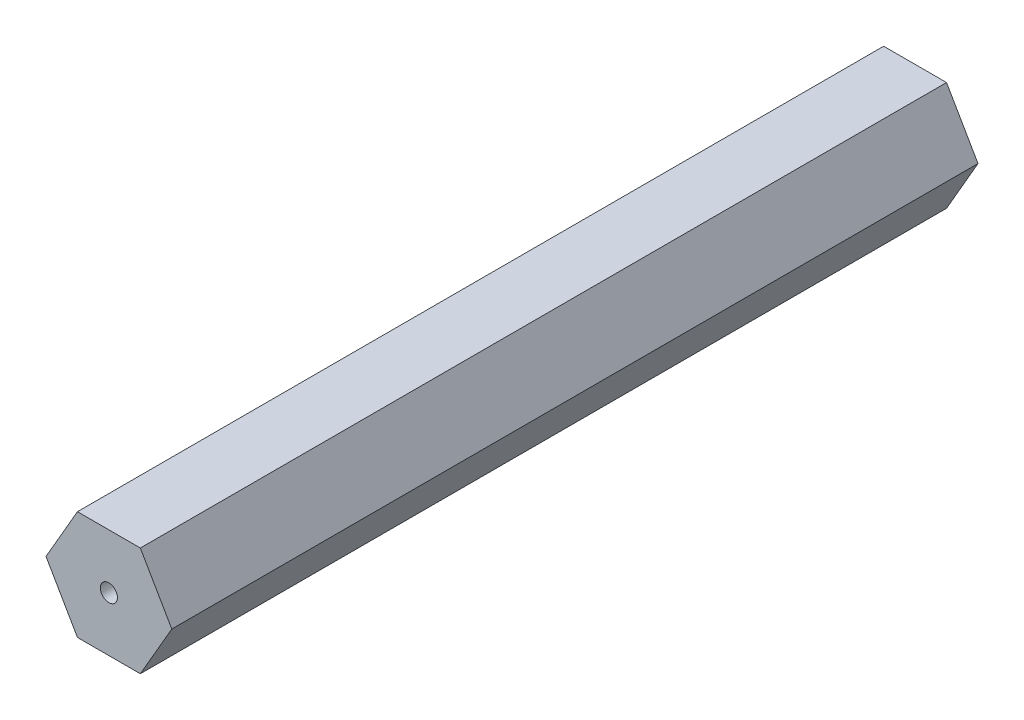
ISO-10303-21;
HEADER;
FILE_DESCRIPTION(('STEP AP214'),'2;1');
FILE_NAME('part.step','',(''),(''),'','','');
FILE_SCHEMA(('AUTOMOTIVE_DESIGN { 1 0 10303 214 1 1 1 1 }'));
ENDSEC;
DATA;
#1=APPLICATION_CONTEXT('core data for automotive mechanical design processes');
#2=APPLICATION_PROTOCOL_DEFINITION('international standard','automotive_design',2000,#1);
#3=PRODUCT_CONTEXT('',#1,'mechanical');
#4=PRODUCT('Part','Part','',(#3));
#5=PRODUCT_RELATED_PRODUCT_CATEGORY('part','',(#4));
#6=PRODUCT_DEFINITION_FORMATION('','',#4);
#7=PRODUCT_DEFINITION_CONTEXT('part definition',#1,'design');
#8=PRODUCT_DEFINITION('design','',#6,#7);
#9=PRODUCT_DEFINITION_SHAPE('','',#8);
#10=(LENGTH_UNIT() NAMED_UNIT(*) SI_UNIT(.MILLI.,.METRE.));
#11=(NAMED_UNIT(*) PLANE_ANGLE_UNIT() SI_UNIT($,.RADIAN.));
#12=(NAMED_UNIT(*) SI_UNIT($,.STERADIAN.) SOLID_ANGLE_UNIT());
#13=UNCERTAINTY_MEASURE_WITH_UNIT(LENGTH_MEASURE(1.E-05),#10,'distance_accuracy_value','');
#14=(GEOMETRIC_REPRESENTATION_CONTEXT(3) GLOBAL_UNCERTAINTY_ASSIGNED_CONTEXT((#13)) GLOBAL_UNIT_ASSIGNED_CONTEXT((#10,
#11,#12)) REPRESENTATION_CONTEXT('',''));
#15=CARTESIAN_POINT('',(0.,0.,0.));
#16=DIRECTION('',(0.,0.,1.));
#17=DIRECTION('',(1.,0.,0.));
#18=AXIS2_PLACEMENT_3D('',#15,#16,#17);
#19=CARTESIAN_POINT('',(3.66617420935419,-6.34999999999994,94.));
#20=DIRECTION('',(-0.866025403784441,0.499999999999995,0.));
#21=DIRECTION('',(-0.499999999999995,-0.866025403784442,0.));
#22=AXIS2_PLACEMENT_3D('',#19,#20,#21);
#23=PLANE('',#22);
#24=DIRECTION('',(0.499999999999995,0.866025403784442,0.));
#25=VECTOR('',#24,1.);
#26=CARTESIAN_POINT('',(3.66617420935419,-6.34999999999994,0.));
#27=LINE('',#26,#25);
#28=CARTESIAN_POINT('',(3.66617420935419,-6.34999999999994,0.));
#29=VERTEX_POINT('',#28);
#30=CARTESIAN_POINT('',(7.33234841870822,0.,0.));
#31=VERTEX_POINT('',#30);
#32=EDGE_CURVE('E122',#29,#31,#27,.T.);
#33=ORIENTED_EDGE('',*,*,#32,.T.);
#34=DIRECTION('',(0.,0.,-1.));
#35=VECTOR('',#34,1.);
#36=CARTESIAN_POINT('',(7.33234841870822,0.,94.));
#37=LINE('',#36,#35);
#38=CARTESIAN_POINT('',(7.33234841870822,0.,94.));
#39=VERTEX_POINT('',#38);
#40=EDGE_CURVE('E11',#39,#31,#37,.T.);
#41=ORIENTED_EDGE('',*,*,#40,.F.);
#42=DIRECTION('',(0.499999999999995,0.866025403784442,0.));
#43=VECTOR('',#42,1.);
#44=CARTESIAN_POINT('',(3.66617420935419,-6.34999999999994,94.));
#45=LINE('',#44,#43);
#46=CARTESIAN_POINT('',(3.66617420935419,-6.34999999999994,94.));
#47=VERTEX_POINT('',#46);
#48=EDGE_CURVE('E133',#47,#39,#45,.T.);
#49=ORIENTED_EDGE('',*,*,#48,.F.);
#50=DIRECTION('',(0.,0.,-1.));
#51=VECTOR('',#50,1.);
#52=CARTESIAN_POINT('',(3.66617420935419,-6.34999999999994,94.));
#53=LINE('',#52,#51);
#54=EDGE_CURVE('E118',#47,#29,#53,.T.);
#55=ORIENTED_EDGE('',*,*,#54,.T.);
#56=EDGE_LOOP('',(#33,#41,#49,#55));
#57=FACE_BOUND('',#56,.T.);
#58=ADVANCED_FACE('F38',(#57),#23,.F.);
#59=CARTESIAN_POINT('',(7.33234841870822,0.,94.));
#60=DIRECTION('',(-0.866025403784438,-0.500000000000001,0.));
#61=DIRECTION('',(0.500000000000001,-0.866025403784438,0.));
#62=AXIS2_PLACEMENT_3D('',#59,#60,#61);
#63=PLANE('',#62);
#64=DIRECTION('',(-0.500000000000001,0.866025403784438,0.));
#65=VECTOR('',#64,1.);
#66=CARTESIAN_POINT('',(7.33234841870822,0.,0.));
#67=LINE('',#66,#65);
#68=CARTESIAN_POINT('',(3.6661742093541,6.34999999999999,0.));
#69=VERTEX_POINT('',#68);
#70=EDGE_CURVE('E125',#31,#69,#67,.T.);
#71=ORIENTED_EDGE('',*,*,#70,.T.);
#72=DIRECTION('',(0.,0.,-1.));
#73=VECTOR('',#72,1.);
#74=CARTESIAN_POINT('',(3.6661742093541,6.34999999999999,94.));
#75=LINE('',#74,#73);
#76=CARTESIAN_POINT('',(3.6661742093541,6.34999999999999,94.));
#77=VERTEX_POINT('',#76);
#78=EDGE_CURVE('E46',#77,#69,#75,.T.);
#79=ORIENTED_EDGE('',*,*,#78,.F.);
#80=DIRECTION('',(-0.500000000000001,0.866025403784438,0.));
#81=VECTOR('',#80,1.);
#82=CARTESIAN_POINT('',(7.33234841870822,0.,94.));
#83=LINE('',#82,#81);
#84=EDGE_CURVE('E91',#39,#77,#83,.T.);
#85=ORIENTED_EDGE('',*,*,#84,.F.);
#86=ORIENTED_EDGE('',*,*,#40,.T.);
#87=EDGE_LOOP('',(#71,#79,#85,#86));
#88=FACE_BOUND('',#87,.T.);
#89=ADVANCED_FACE('F158',(#88),#63,.F.);
#90=CARTESIAN_POINT('',(3.6661742093541,6.34999999999999,94.));
#91=DIRECTION('',(0.,-1.,0.));
#92=DIRECTION('',(1.,0.,0.));
#93=AXIS2_PLACEMENT_3D('',#90,#91,#92);
#94=PLANE('',#93);
#95=DIRECTION('',(-1.,0.,0.));
#96=VECTOR('',#95,1.);
#97=CARTESIAN_POINT('',(3.6661742093541,6.34999999999999,0.));
#98=LINE('',#97,#96);
#99=CARTESIAN_POINT('',(-3.66617420935414,6.34999999999996,0.));
#100=VERTEX_POINT('',#99);
#101=EDGE_CURVE('E128',#69,#100,#98,.T.);
#102=ORIENTED_EDGE('',*,*,#101,.T.);
#103=DIRECTION('',(0.,0.,-1.));
#104=VECTOR('',#103,1.);
#105=CARTESIAN_POINT('',(-3.66617420935414,6.34999999999996,94.));
#106=LINE('',#105,#104);
#107=CARTESIAN_POINT('',(-3.66617420935414,6.34999999999996,94.));
#108=VERTEX_POINT('',#107);
#109=EDGE_CURVE('E113',#108,#100,#106,.T.);
#110=ORIENTED_EDGE('',*,*,#109,.F.);
#111=DIRECTION('',(-1.,0.,0.));
#112=VECTOR('',#111,1.);
#113=CARTESIAN_POINT('',(3.6661742093541,6.34999999999999,94.));
#114=LINE('',#113,#112);
#115=EDGE_CURVE('E104',#77,#108,#114,.T.);
#116=ORIENTED_EDGE('',*,*,#115,.F.);
#117=ORIENTED_EDGE('',*,*,#78,.T.);
#118=EDGE_LOOP('',(#102,#110,#116,#117));
#119=FACE_BOUND('',#118,.T.);
#120=ADVANCED_FACE('F139',(#119),#94,.F.);
#121=CARTESIAN_POINT('',(-3.66617420935414,6.34999999999996,94.));
#122=DIRECTION('',(0.866025403784441,-0.499999999999995,0.));
#123=DIRECTION('',(0.499999999999995,0.866025403784442,0.));
#124=AXIS2_PLACEMENT_3D('',#121,#122,#123);
#125=PLANE('',#124);
#126=DIRECTION('',(-0.499999999999995,-0.866025403784441,0.));
#127=VECTOR('',#126,1.);
#128=CARTESIAN_POINT('',(-3.66617420935414,6.34999999999996,0.));
#129=LINE('',#128,#127);
#130=CARTESIAN_POINT('',(-7.33234841870822,0.,0.));
#131=VERTEX_POINT('',#130);
#132=EDGE_CURVE('E112',#100,#131,#129,.T.);
#133=ORIENTED_EDGE('',*,*,#132,.T.);
#134=DIRECTION('',(0.,0.,-1.));
#135=VECTOR('',#134,1.);
#136=CARTESIAN_POINT('',(-7.33234841870822,0.,94.));
#137=LINE('',#136,#135);
#138=CARTESIAN_POINT('',(-7.33234841870822,0.,94.));
#139=VERTEX_POINT('',#138);
#140=EDGE_CURVE('E109',#139,#131,#137,.T.);
#141=ORIENTED_EDGE('',*,*,#140,.F.);
#142=DIRECTION('',(-0.499999999999995,-0.866025403784441,0.));
#143=VECTOR('',#142,1.);
#144=CARTESIAN_POINT('',(-3.66617420935414,6.34999999999996,94.));
#145=LINE('',#144,#143);
#146=EDGE_CURVE('E98',#108,#139,#145,.T.);
#147=ORIENTED_EDGE('',*,*,#146,.F.);
#148=ORIENTED_EDGE('',*,*,#109,.T.);
#149=EDGE_LOOP('',(#133,#141,#147,#148));
#150=FACE_BOUND('',#149,.T.);
#151=ADVANCED_FACE('F110',(#150),#125,.F.);
#152=CARTESIAN_POINT('',(-7.33234841870822,0.,94.));
#153=DIRECTION('',(0.866025403784434,0.500000000000007,0.));
#154=DIRECTION('',(-0.500000000000007,0.866025403784435,0.));
#155=AXIS2_PLACEMENT_3D('',#152,#153,#154);
#156=PLANE('',#155);
#157=DIRECTION('',(0.500000000000007,-0.866025403784434,0.));
#158=VECTOR('',#157,1.);
#159=CARTESIAN_POINT('',(-7.33234841870822,0.,0.));
#160=LINE('',#159,#158);
#161=CARTESIAN_POINT('',(-3.66617420935405,-6.35000000000001,0.));
#162=VERTEX_POINT('',#161);
#163=EDGE_CURVE('E77',#131,#162,#160,.T.);
#164=ORIENTED_EDGE('',*,*,#163,.T.);
#165=DIRECTION('',(0.,0.,-1.));
#166=VECTOR('',#165,1.);
#167=CARTESIAN_POINT('',(-3.66617420935405,-6.35000000000001,94.));
#168=LINE('',#167,#166);
#169=CARTESIAN_POINT('',(-3.66617420935405,-6.35000000000001,94.));
#170=VERTEX_POINT('',#169);
#171=EDGE_CURVE('E114',#170,#162,#168,.T.);
#172=ORIENTED_EDGE('',*,*,#171,.F.);
#173=DIRECTION('',(0.500000000000007,-0.866025403784434,0.));
#174=VECTOR('',#173,1.);
#175=CARTESIAN_POINT('',(-7.33234841870822,0.,94.));
#176=LINE('',#175,#174);
#177=EDGE_CURVE('E102',#139,#170,#176,.T.);
#178=ORIENTED_EDGE('',*,*,#177,.F.);
#179=ORIENTED_EDGE('',*,*,#140,.T.);
#180=EDGE_LOOP('',(#164,#172,#178,#179));
#181=FACE_BOUND('',#180,.T.);
#182=ADVANCED_FACE('F116',(#181),#156,.F.);
#183=CARTESIAN_POINT('',(-3.66617420935405,-6.35000000000001,94.));
#184=DIRECTION('',(0.,1.,0.));
#185=DIRECTION('',(-1.,0.,0.));
#186=AXIS2_PLACEMENT_3D('',#183,#184,#185);
#187=PLANE('',#186);
#188=DIRECTION('',(1.,0.,0.));
#189=VECTOR('',#188,1.);
#190=CARTESIAN_POINT('',(-3.66617420935405,-6.35000000000001,0.));
#191=LINE('',#190,#189);
#192=EDGE_CURVE('E83',#162,#29,#191,.T.);
#193=ORIENTED_EDGE('',*,*,#192,.T.);
#194=ORIENTED_EDGE('',*,*,#54,.F.);
#195=DIRECTION('',(1.,0.,0.));
#196=VECTOR('',#195,1.);
#197=CARTESIAN_POINT('',(-3.66617420935405,-6.35000000000001,94.));
#198=LINE('',#197,#196);
#199=EDGE_CURVE('E54',#170,#47,#198,.T.);
#200=ORIENTED_EDGE('',*,*,#199,.F.);
#201=ORIENTED_EDGE('',*,*,#171,.T.);
#202=EDGE_LOOP('',(#193,#194,#200,#201));
#203=FACE_BOUND('',#202,.T.);
#204=ADVANCED_FACE('F146',(#203),#187,.F.);
#205=CARTESIAN_POINT('',(0.,0.,94.));
#206=DIRECTION('',(0.,0.,1.));
#207=DIRECTION('',(1.,0.,0.));
#208=AXIS2_PLACEMENT_3D('',#205,#206,#207);
#209=PLANE('',#208);
#210=CARTESIAN_POINT('',(0.,0.,94.));
#211=DIRECTION('',(0.,0.,1.));
#212=DIRECTION('',(1.,0.,0.));
#213=AXIS2_PLACEMENT_3D('',#210,#211,#212);
#214=CIRCLE('',#213,1.);
#215=CARTESIAN_POINT('',(1.,0.,94.));
#216=VERTEX_POINT('',#215);
#217=EDGE_CURVE('E241',#216,#216,#214,.T.);
#218=ORIENTED_EDGE('',*,*,#217,.F.);
#219=EDGE_LOOP('',(#218));
#220=FACE_BOUND('',#219,.T.);
#221=ORIENTED_EDGE('',*,*,#48,.T.);
#222=ORIENTED_EDGE('',*,*,#84,.T.);
#223=ORIENTED_EDGE('',*,*,#115,.T.);
#224=ORIENTED_EDGE('',*,*,#146,.T.);
#225=ORIENTED_EDGE('',*,*,#177,.T.);
#226=ORIENTED_EDGE('',*,*,#199,.T.);
#227=EDGE_LOOP('',(#221,#222,#223,#224,#225,#226));
#228=FACE_BOUND('',#227,.T.);
#229=ADVANCED_FACE('F100',(#220,#228),#209,.T.);
#230=CARTESIAN_POINT('',(0.,0.,0.));
#231=DIRECTION('',(0.,0.,1.));
#232=DIRECTION('',(1.,0.,0.));
#233=AXIS2_PLACEMENT_3D('',#230,#231,#232);
#234=PLANE('',#233);
#235=CARTESIAN_POINT('',(0.,0.,0.));
#236=DIRECTION('',(0.,0.,1.));
#237=DIRECTION('',(1.,0.,0.));
#238=AXIS2_PLACEMENT_3D('',#235,#236,#237);
#239=CIRCLE('',#238,1.);
#240=CARTESIAN_POINT('',(1.,0.,0.));
#241=VERTEX_POINT('',#240);
#242=EDGE_CURVE('E126',#241,#241,#239,.T.);
#243=ORIENTED_EDGE('',*,*,#242,.T.);
#244=EDGE_LOOP('',(#243));
#245=FACE_BOUND('',#244,.T.);
#246=ORIENTED_EDGE('',*,*,#32,.F.);
#247=ORIENTED_EDGE('',*,*,#192,.F.);
#248=ORIENTED_EDGE('',*,*,#163,.F.);
#249=ORIENTED_EDGE('',*,*,#132,.F.);
#250=ORIENTED_EDGE('',*,*,#101,.F.);
#251=ORIENTED_EDGE('',*,*,#70,.F.);
#252=EDGE_LOOP('',(#246,#247,#248,#249,#250,#251));
#253=FACE_BOUND('',#252,.T.);
#254=ADVANCED_FACE('F142',(#245,#253),#234,.F.);
#255=CARTESIAN_POINT('',(0.,0.,0.));
#256=DIRECTION('',(0.,0.,1.));
#257=DIRECTION('',(1.,0.,0.));
#258=AXIS2_PLACEMENT_3D('',#255,#256,#257);
#259=CYLINDRICAL_SURFACE('',#258,1.);
#260=ORIENTED_EDGE('',*,*,#242,.F.);
#261=EDGE_LOOP('',(#260));
#262=FACE_BOUND('',#261,.T.);
#263=ORIENTED_EDGE('',*,*,#217,.T.);
#264=EDGE_LOOP('',(#263));
#265=FACE_BOUND('',#264,.T.);
#266=ADVANCED_FACE('F219',(#262,#265),#259,.F.);
#267=CLOSED_SHELL('',(#58,#89,#120,#151,#182,#204,#229,#254,#266));
#268=MANIFOLD_SOLID_BREP('B2',#267);
#269=ADVANCED_BREP_SHAPE_REPRESENTATION('',(#18,#268),#14);
#270=SHAPE_DEFINITION_REPRESENTATION(#9,#269);
ENDSEC;
END-ISO-10303-21;
